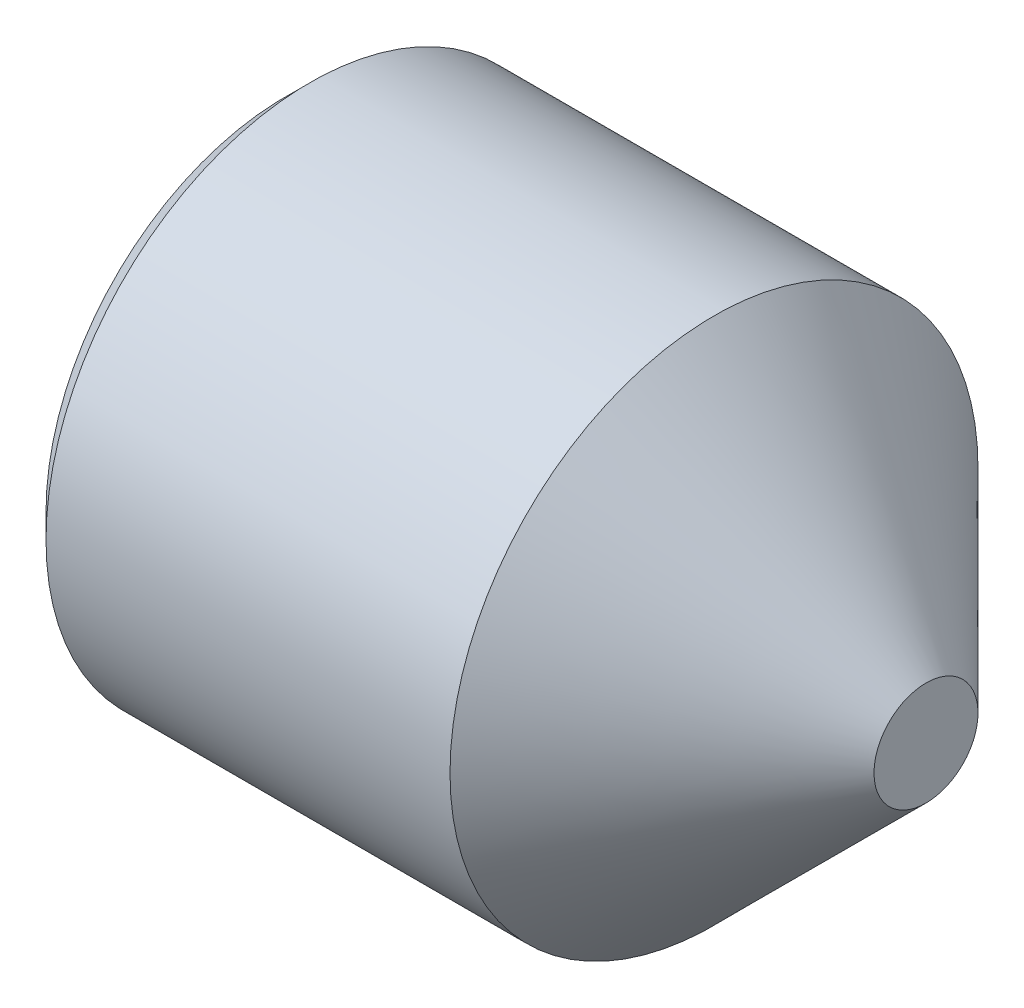
ISO-10303-21;
HEADER;
FILE_DESCRIPTION(('STEP AP214'),'2;1');
FILE_NAME('part.step','',(''),(''),'','','');
FILE_SCHEMA(('AUTOMOTIVE_DESIGN { 1 0 10303 214 1 1 1 1 }'));
ENDSEC;
DATA;
#1=APPLICATION_CONTEXT('core data for automotive mechanical design processes');
#2=APPLICATION_PROTOCOL_DEFINITION('international standard','automotive_design',2000,#1);
#3=PRODUCT_CONTEXT('',#1,'mechanical');
#4=PRODUCT('Part','Part','',(#3));
#5=PRODUCT_RELATED_PRODUCT_CATEGORY('part','',(#4));
#6=PRODUCT_DEFINITION_FORMATION('','',#4);
#7=PRODUCT_DEFINITION_CONTEXT('part definition',#1,'design');
#8=PRODUCT_DEFINITION('design','',#6,#7);
#9=PRODUCT_DEFINITION_SHAPE('','',#8);
#10=(LENGTH_UNIT() NAMED_UNIT(*) SI_UNIT(.MILLI.,.METRE.));
#11=(NAMED_UNIT(*) PLANE_ANGLE_UNIT() SI_UNIT($,.RADIAN.));
#12=(NAMED_UNIT(*) SI_UNIT($,.STERADIAN.) SOLID_ANGLE_UNIT());
#13=UNCERTAINTY_MEASURE_WITH_UNIT(LENGTH_MEASURE(1.E-05),#10,'distance_accuracy_value','');
#14=(GEOMETRIC_REPRESENTATION_CONTEXT(3) GLOBAL_UNCERTAINTY_ASSIGNED_CONTEXT((#13)) GLOBAL_UNIT_ASSIGNED_CONTEXT((#10,
#11,#12)) REPRESENTATION_CONTEXT('',''));
#15=CARTESIAN_POINT('',(0.,0.,0.));
#16=DIRECTION('',(0.,0.,1.));
#17=DIRECTION('',(1.,0.,0.));
#18=AXIS2_PLACEMENT_3D('',#15,#16,#17);
#19=CARTESIAN_POINT('',(1.19999999988631,0.,0.750555349946514));
#20=DIRECTION('',(-1.,0.,0.));
#21=DIRECTION('',(0.,0.,1.));
#22=AXIS2_PLACEMENT_3D('',#19,#20,#21);
#23=PLANE('',#22);
#24=DIRECTION('',(0.,0.,-1.));
#25=VECTOR('',#24,1.);
#26=CARTESIAN_POINT('',(1.19999999988631,0.65,0.375277674973256));
#27=LINE('',#26,#25);
#28=CARTESIAN_POINT('',(1.19999999988631,0.65,0.375277674973256));
#29=VERTEX_POINT('',#28);
#30=CARTESIAN_POINT('',(1.19999999988631,0.65,0.));
#31=VERTEX_POINT('',#30);
#32=EDGE_CURVE('E162',#29,#31,#27,.T.);
#33=ORIENTED_EDGE('',*,*,#32,.T.);
#34=CARTESIAN_POINT('',(1.19999999988631,0.,0.));
#35=DIRECTION('',(1.,0.,0.));
#36=DIRECTION('',(0.,1.,0.));
#37=AXIS2_PLACEMENT_3D('',#34,#35,#36);
#38=CIRCLE('',#37,0.65);
#39=CARTESIAN_POINT('',(1.19999999988631,0.325000000000001,0.562916512459885));
#40=VERTEX_POINT('',#39);
#41=EDGE_CURVE('E51',#31,#40,#38,.T.);
#42=ORIENTED_EDGE('',*,*,#41,.T.);
#43=DIRECTION('',(0.,0.866025403784438,-0.500000000000001));
#44=VECTOR('',#43,1.);
#45=CARTESIAN_POINT('',(1.19999999988631,0.,0.750555349946514));
#46=LINE('',#45,#44);
#47=EDGE_CURVE('E218',#40,#29,#46,.T.);
#48=ORIENTED_EDGE('',*,*,#47,.T.);
#49=EDGE_LOOP('',(#33,#42,#48));
#50=FACE_BOUND('',#49,.T.);
#51=ADVANCED_FACE('F40',(#50),#23,.T.);
#52=CARTESIAN_POINT('',(1.19999999988631,0.,0.750555349946514));
#53=VERTEX_POINT('',#52);
#54=EDGE_CURVE('E223',#53,#40,#46,.T.);
#55=ORIENTED_EDGE('',*,*,#54,.T.);
#56=CARTESIAN_POINT('',(1.19999999988631,-0.325,0.562916512459885));
#57=VERTEX_POINT('',#56);
#58=EDGE_CURVE('E11',#40,#57,#38,.T.);
#59=ORIENTED_EDGE('',*,*,#58,.T.);
#60=DIRECTION('',(0.,0.866025403784438,0.5));
#61=VECTOR('',#60,1.);
#62=CARTESIAN_POINT('',(1.19999999988631,-0.65,0.375277674973257));
#63=LINE('',#62,#61);
#64=EDGE_CURVE('E188',#57,#53,#63,.T.);
#65=ORIENTED_EDGE('',*,*,#64,.T.);
#66=EDGE_LOOP('',(#55,#59,#65));
#67=FACE_BOUND('',#66,.T.);
#68=ADVANCED_FACE('F127',(#67),#23,.T.);
#69=CARTESIAN_POINT('',(1.19999999988631,-0.65,0.375277674973257));
#70=VERTEX_POINT('',#69);
#71=EDGE_CURVE('E224',#70,#57,#63,.T.);
#72=ORIENTED_EDGE('',*,*,#71,.T.);
#73=CARTESIAN_POINT('',(1.19999999988631,-0.65,0.));
#74=VERTEX_POINT('',#73);
#75=EDGE_CURVE('E49',#57,#74,#38,.T.);
#76=ORIENTED_EDGE('',*,*,#75,.T.);
#77=DIRECTION('',(0.,0.,1.));
#78=VECTOR('',#77,1.);
#79=CARTESIAN_POINT('',(1.19999999988631,-0.65,-0.375277674973256));
#80=LINE('',#79,#78);
#81=EDGE_CURVE('E167',#74,#70,#80,.T.);
#82=ORIENTED_EDGE('',*,*,#81,.T.);
#83=EDGE_LOOP('',(#72,#76,#82));
#84=FACE_BOUND('',#83,.T.);
#85=ADVANCED_FACE('F133',(#84),#23,.T.);
#86=CARTESIAN_POINT('',(1.19999999988631,-0.65,-0.375277674973256));
#87=VERTEX_POINT('',#86);
#88=EDGE_CURVE('E168',#87,#74,#80,.T.);
#89=ORIENTED_EDGE('',*,*,#88,.T.);
#90=CARTESIAN_POINT('',(1.19999999988631,-0.325,-0.562916512459885));
#91=VERTEX_POINT('',#90);
#92=EDGE_CURVE('E215',#74,#91,#38,.T.);
#93=ORIENTED_EDGE('',*,*,#92,.T.);
#94=DIRECTION('',(0.,-0.866025403784438,0.5));
#95=VECTOR('',#94,1.);
#96=CARTESIAN_POINT('',(1.19999999988631,0.,-0.750555349946513));
#97=LINE('',#96,#95);
#98=EDGE_CURVE('E157',#91,#87,#97,.T.);
#99=ORIENTED_EDGE('',*,*,#98,.T.);
#100=EDGE_LOOP('',(#89,#93,#99));
#101=FACE_BOUND('',#100,.T.);
#102=ADVANCED_FACE('F146',(#101),#23,.T.);
#103=CARTESIAN_POINT('',(1.19999999988631,0.,-0.750555349946513));
#104=VERTEX_POINT('',#103);
#105=EDGE_CURVE('E160',#104,#91,#97,.T.);
#106=ORIENTED_EDGE('',*,*,#105,.T.);
#107=CARTESIAN_POINT('',(1.19999999988631,0.325,-0.562916512459885));
#108=VERTEX_POINT('',#107);
#109=EDGE_CURVE('E213',#91,#108,#38,.T.);
#110=ORIENTED_EDGE('',*,*,#109,.T.);
#111=DIRECTION('',(0.,-0.866025403784439,-0.5));
#112=VECTOR('',#111,1.);
#113=CARTESIAN_POINT('',(1.19999999988631,0.65,-0.375277674973257));
#114=LINE('',#113,#112);
#115=EDGE_CURVE('E158',#108,#104,#114,.T.);
#116=ORIENTED_EDGE('',*,*,#115,.T.);
#117=EDGE_LOOP('',(#106,#110,#116));
#118=FACE_BOUND('',#117,.T.);
#119=ADVANCED_FACE('F138',(#118),#23,.T.);
#120=CARTESIAN_POINT('',(1.19999999988631,0.65,-0.375277674973257));
#121=VERTEX_POINT('',#120);
#122=EDGE_CURVE('E150',#121,#108,#114,.T.);
#123=ORIENTED_EDGE('',*,*,#122,.T.);
#124=EDGE_CURVE('E151',#108,#31,#38,.T.);
#125=ORIENTED_EDGE('',*,*,#124,.T.);
#126=EDGE_CURVE('E153',#31,#121,#27,.T.);
#127=ORIENTED_EDGE('',*,*,#126,.T.);
#128=EDGE_LOOP('',(#123,#125,#127));
#129=FACE_BOUND('',#128,.T.);
#130=ADVANCED_FACE('F129',(#129),#23,.T.);
#131=CARTESIAN_POINT('',(0.,1.5,0.));
#132=DIRECTION('',(1.,0.,0.));
#133=DIRECTION('',(0.,0.,-1.));
#134=AXIS2_PLACEMENT_3D('',#131,#132,#133);
#135=PLANE('',#134);
#136=DIRECTION('',(0.,0.866025403784438,-0.500000000000001));
#137=VECTOR('',#136,1.);
#138=CARTESIAN_POINT('',(-1.13686837721616E-10,0.,0.750555349946514));
#139=LINE('',#138,#137);
#140=CARTESIAN_POINT('',(0.,0.,0.750555349946514));
#141=VERTEX_POINT('',#140);
#142=CARTESIAN_POINT('',(-1.13686837721616E-10,0.65,0.375277674973256));
#143=VERTEX_POINT('',#142);
#144=EDGE_CURVE('E173',#141,#143,#139,.T.);
#145=ORIENTED_EDGE('',*,*,#144,.F.);
#146=DIRECTION('',(0.,0.866025403784438,0.5));
#147=VECTOR('',#146,1.);
#148=CARTESIAN_POINT('',(-1.13686837721616E-10,-0.65,0.375277674973257));
#149=LINE('',#148,#147);
#150=CARTESIAN_POINT('',(-1.13686837721616E-10,-0.65,0.375277674973257));
#151=VERTEX_POINT('',#150);
#152=EDGE_CURVE('E65',#151,#141,#149,.T.);
#153=ORIENTED_EDGE('',*,*,#152,.F.);
#154=DIRECTION('',(0.,0.,1.));
#155=VECTOR('',#154,1.);
#156=CARTESIAN_POINT('',(-1.13686837721616E-10,-0.65,-0.375277674973256));
#157=LINE('',#156,#155);
#158=CARTESIAN_POINT('',(-1.13686837721616E-10,-0.65,-0.375277674973256));
#159=VERTEX_POINT('',#158);
#160=EDGE_CURVE('E185',#159,#151,#157,.T.);
#161=ORIENTED_EDGE('',*,*,#160,.F.);
#162=DIRECTION('',(0.,-0.866025403784438,0.5));
#163=VECTOR('',#162,1.);
#164=CARTESIAN_POINT('',(-1.13686837721616E-10,0.,-0.750555349946513));
#165=LINE('',#164,#163);
#166=CARTESIAN_POINT('',(-1.13686837721616E-10,0.,-0.750555349946513));
#167=VERTEX_POINT('',#166);
#168=EDGE_CURVE('E182',#167,#159,#165,.T.);
#169=ORIENTED_EDGE('',*,*,#168,.F.);
#170=DIRECTION('',(0.,-0.866025403784439,-0.5));
#171=VECTOR('',#170,1.);
#172=CARTESIAN_POINT('',(-1.13686837721616E-10,0.65,-0.375277674973257));
#173=LINE('',#172,#171);
#174=CARTESIAN_POINT('',(-1.13686837721616E-10,0.65,-0.375277674973257));
#175=VERTEX_POINT('',#174);
#176=EDGE_CURVE('E179',#175,#167,#173,.T.);
#177=ORIENTED_EDGE('',*,*,#176,.F.);
#178=DIRECTION('',(0.,0.,-1.));
#179=VECTOR('',#178,1.);
#180=CARTESIAN_POINT('',(-1.13686837721616E-10,0.65,0.375277674973256));
#181=LINE('',#180,#179);
#182=EDGE_CURVE('E176',#143,#175,#181,.T.);
#183=ORIENTED_EDGE('',*,*,#182,.F.);
#184=EDGE_LOOP('',(#145,#153,#161,#169,#177,#183));
#185=FACE_BOUND('',#184,.T.);
#186=CARTESIAN_POINT('',(0.,0.,0.));
#187=DIRECTION('',(-1.,0.,0.));
#188=DIRECTION('',(0.,0.,1.));
#189=AXIS2_PLACEMENT_3D('',#186,#187,#188);
#190=CIRCLE('',#189,1.5);
#191=CARTESIAN_POINT('',(0.,0.,1.5));
#192=VERTEX_POINT('',#191);
#193=EDGE_CURVE('E191',#192,#192,#190,.T.);
#194=ORIENTED_EDGE('',*,*,#193,.T.);
#195=EDGE_LOOP('',(#194));
#196=FACE_BOUND('',#195,.T.);
#197=ADVANCED_FACE('F42',(#185,#196),#135,.F.);
#198=CARTESIAN_POINT('',(4.,0.,0.));
#199=DIRECTION('',(-1.,0.,0.));
#200=DIRECTION('',(0.,0.,1.));
#201=AXIS2_PLACEMENT_3D('',#198,#199,#200);
#202=PLANE('',#201);
#203=CARTESIAN_POINT('',(4.,0.,0.));
#204=DIRECTION('',(-1.,0.,0.));
#205=DIRECTION('',(0.,0.,1.));
#206=AXIS2_PLACEMENT_3D('',#203,#204,#205);
#207=CIRCLE('',#206,0.325);
#208=CARTESIAN_POINT('',(4.,0.,0.325));
#209=VERTEX_POINT('',#208);
#210=EDGE_CURVE('E44',#209,#209,#207,.T.);
#211=ORIENTED_EDGE('',*,*,#210,.F.);
#212=EDGE_LOOP('',(#211));
#213=FACE_BOUND('',#212,.T.);
#214=ADVANCED_FACE('F144',(#213),#202,.F.);
#215=CARTESIAN_POINT('',(4.,0.,0.));
#216=DIRECTION('',(-1.,0.,0.));
#217=DIRECTION('',(0.,0.,1.));
#218=AXIS2_PLACEMENT_3D('',#215,#216,#217);
#219=CONICAL_SURFACE('',#218,0.325,0.785398163397443);
#220=CARTESIAN_POINT('',(2.67499999999998,0.,0.));
#221=DIRECTION('',(-1.,0.,0.));
#222=DIRECTION('',(0.,0.,1.));
#223=AXIS2_PLACEMENT_3D('',#220,#221,#222);
#224=CIRCLE('',#223,1.65);
#225=CARTESIAN_POINT('',(2.67499999999998,0.,1.65));
#226=VERTEX_POINT('',#225);
#227=EDGE_CURVE('E206',#226,#226,#224,.T.);
#228=ORIENTED_EDGE('',*,*,#227,.F.);
#229=EDGE_LOOP('',(#228));
#230=FACE_BOUND('',#229,.T.);
#231=ORIENTED_EDGE('',*,*,#210,.T.);
#232=EDGE_LOOP('',(#231));
#233=FACE_BOUND('',#232,.T.);
#234=ADVANCED_FACE('F271',(#230,#233),#219,.T.);
#235=CARTESIAN_POINT('',(-14.774129749189,0.,0.));
#236=DIRECTION('',(-1.,0.,0.));
#237=DIRECTION('',(0.,0.,1.));
#238=AXIS2_PLACEMENT_3D('',#235,#236,#237);
#239=CYLINDRICAL_SURFACE('',#238,1.65);
#240=CARTESIAN_POINT('',(0.150000000000001,0.,0.));
#241=DIRECTION('',(-1.,0.,0.));
#242=DIRECTION('',(0.,0.,1.));
#243=AXIS2_PLACEMENT_3D('',#240,#241,#242);
#244=CIRCLE('',#243,1.65);
#245=CARTESIAN_POINT('',(0.150000000000001,0.,1.65));
#246=VERTEX_POINT('',#245);
#247=EDGE_CURVE('E204',#246,#246,#244,.T.);
#248=ORIENTED_EDGE('',*,*,#247,.F.);
#249=EDGE_LOOP('',(#248));
#250=FACE_BOUND('',#249,.T.);
#251=ORIENTED_EDGE('',*,*,#227,.T.);
#252=EDGE_LOOP('',(#251));
#253=FACE_BOUND('',#252,.T.);
#254=ADVANCED_FACE('F267',(#250,#253),#239,.T.);
#255=CARTESIAN_POINT('',(0.150000000000001,0.,0.));
#256=DIRECTION('',(1.,0.,0.));
#257=DIRECTION('',(0.,0.,-1.));
#258=AXIS2_PLACEMENT_3D('',#255,#256,#257);
#259=CONICAL_SURFACE('',#258,1.65,0.785398163397444);
#260=ORIENTED_EDGE('',*,*,#193,.F.);
#261=EDGE_LOOP('',(#260));
#262=FACE_BOUND('',#261,.T.);
#263=ORIENTED_EDGE('',*,*,#247,.T.);
#264=EDGE_LOOP('',(#263));
#265=FACE_BOUND('',#264,.T.);
#266=ADVANCED_FACE('F258',(#262,#265),#259,.T.);
#267=CARTESIAN_POINT('',(1.19999999988631,-0.65,0.375277674973257));
#268=DIRECTION('',(0.,-0.5,0.866025403784439));
#269=DIRECTION('',(0.,-0.866025403784439,-0.5));
#270=AXIS2_PLACEMENT_3D('',#267,#268,#269);
#271=PLANE('',#270);
#272=ORIENTED_EDGE('',*,*,#152,.T.);
#273=DIRECTION('',(-1.,0.,0.));
#274=VECTOR('',#273,1.);
#275=CARTESIAN_POINT('',(1.19999999988631,0.,0.750555349946514));
#276=LINE('',#275,#274);
#277=EDGE_CURVE('E171',#53,#141,#276,.T.);
#278=ORIENTED_EDGE('',*,*,#277,.F.);
#279=ORIENTED_EDGE('',*,*,#64,.F.);
#280=ORIENTED_EDGE('',*,*,#71,.F.);
#281=DIRECTION('',(-1.,0.,0.));
#282=VECTOR('',#281,1.);
#283=CARTESIAN_POINT('',(1.19999999988631,-0.65,0.375277674973257));
#284=LINE('',#283,#282);
#285=EDGE_CURVE('E189',#70,#151,#284,.T.);
#286=ORIENTED_EDGE('',*,*,#285,.T.);
#287=EDGE_LOOP('',(#272,#278,#279,#280,#286));
#288=FACE_BOUND('',#287,.T.);
#289=ADVANCED_FACE('F232',(#288),#271,.F.);
#290=CARTESIAN_POINT('',(1.19999999988631,-0.65,-0.375277674973256));
#291=DIRECTION('',(0.,-1.,0.));
#292=DIRECTION('',(0.,0.,-1.));
#293=AXIS2_PLACEMENT_3D('',#290,#291,#292);
#294=PLANE('',#293);
#295=ORIENTED_EDGE('',*,*,#160,.T.);
#296=ORIENTED_EDGE('',*,*,#285,.F.);
#297=ORIENTED_EDGE('',*,*,#81,.F.);
#298=ORIENTED_EDGE('',*,*,#88,.F.);
#299=DIRECTION('',(-1.,0.,0.));
#300=VECTOR('',#299,1.);
#301=CARTESIAN_POINT('',(1.19999999988631,-0.65,-0.375277674973256));
#302=LINE('',#301,#300);
#303=EDGE_CURVE('E192',#87,#159,#302,.T.);
#304=ORIENTED_EDGE('',*,*,#303,.T.);
#305=EDGE_LOOP('',(#295,#296,#297,#298,#304));
#306=FACE_BOUND('',#305,.T.);
#307=ADVANCED_FACE('F251',(#306),#294,.F.);
#308=CARTESIAN_POINT('',(1.19999999988631,0.,-0.750555349946513));
#309=DIRECTION('',(0.,-0.5,-0.866025403784438));
#310=DIRECTION('',(0.,0.866025403784439,-0.5));
#311=AXIS2_PLACEMENT_3D('',#308,#309,#310);
#312=PLANE('',#311);
#313=ORIENTED_EDGE('',*,*,#168,.T.);
#314=ORIENTED_EDGE('',*,*,#303,.F.);
#315=ORIENTED_EDGE('',*,*,#98,.F.);
#316=ORIENTED_EDGE('',*,*,#105,.F.);
#317=DIRECTION('',(-1.,0.,0.));
#318=VECTOR('',#317,1.);
#319=CARTESIAN_POINT('',(1.19999999988631,0.,-0.750555349946513));
#320=LINE('',#319,#318);
#321=EDGE_CURVE('E194',#104,#167,#320,.T.);
#322=ORIENTED_EDGE('',*,*,#321,.T.);
#323=EDGE_LOOP('',(#313,#314,#315,#316,#322));
#324=FACE_BOUND('',#323,.T.);
#325=ADVANCED_FACE('F245',(#324),#312,.F.);
#326=CARTESIAN_POINT('',(1.19999999988631,0.65,-0.375277674973257));
#327=DIRECTION('',(0.,0.5,-0.866025403784439));
#328=DIRECTION('',(0.,0.866025403784439,0.5));
#329=AXIS2_PLACEMENT_3D('',#326,#327,#328);
#330=PLANE('',#329);
#331=ORIENTED_EDGE('',*,*,#176,.T.);
#332=ORIENTED_EDGE('',*,*,#321,.F.);
#333=ORIENTED_EDGE('',*,*,#115,.F.);
#334=ORIENTED_EDGE('',*,*,#122,.F.);
#335=DIRECTION('',(-1.,0.,0.));
#336=VECTOR('',#335,1.);
#337=CARTESIAN_POINT('',(1.19999999988631,0.65,-0.375277674973257));
#338=LINE('',#337,#336);
#339=EDGE_CURVE('E196',#121,#175,#338,.T.);
#340=ORIENTED_EDGE('',*,*,#339,.T.);
#341=EDGE_LOOP('',(#331,#332,#333,#334,#340));
#342=FACE_BOUND('',#341,.T.);
#343=ADVANCED_FACE('F240',(#342),#330,.F.);
#344=CARTESIAN_POINT('',(1.19999999988631,0.65,0.375277674973256));
#345=DIRECTION('',(0.,1.,0.));
#346=DIRECTION('',(0.,0.,1.));
#347=AXIS2_PLACEMENT_3D('',#344,#345,#346);
#348=PLANE('',#347);
#349=ORIENTED_EDGE('',*,*,#182,.T.);
#350=ORIENTED_EDGE('',*,*,#339,.F.);
#351=ORIENTED_EDGE('',*,*,#126,.F.);
#352=ORIENTED_EDGE('',*,*,#32,.F.);
#353=DIRECTION('',(-1.,0.,0.));
#354=VECTOR('',#353,1.);
#355=CARTESIAN_POINT('',(1.19999999988631,0.65,0.375277674973256));
#356=LINE('',#355,#354);
#357=EDGE_CURVE('E198',#29,#143,#356,.T.);
#358=ORIENTED_EDGE('',*,*,#357,.T.);
#359=EDGE_LOOP('',(#349,#350,#351,#352,#358));
#360=FACE_BOUND('',#359,.T.);
#361=ADVANCED_FACE('F122',(#360),#348,.F.);
#362=CARTESIAN_POINT('',(1.19999999988631,0.,0.750555349946514));
#363=DIRECTION('',(0.,0.5,0.866025403784438));
#364=DIRECTION('',(0.,-0.866025403784438,0.500000000000001));
#365=AXIS2_PLACEMENT_3D('',#362,#363,#364);
#366=PLANE('',#365);
#367=ORIENTED_EDGE('',*,*,#144,.T.);
#368=ORIENTED_EDGE('',*,*,#357,.F.);
#369=ORIENTED_EDGE('',*,*,#47,.F.);
#370=ORIENTED_EDGE('',*,*,#54,.F.);
#371=ORIENTED_EDGE('',*,*,#277,.T.);
#372=EDGE_LOOP('',(#367,#368,#369,#370,#371));
#373=FACE_BOUND('',#372,.T.);
#374=ADVANCED_FACE('F117',(#373),#366,.F.);
#375=CARTESIAN_POINT('',(1.57527767485957,0.,0.));
#376=DIRECTION('',(-1.,0.,0.));
#377=DIRECTION('',(0.,-1.,0.));
#378=AXIS2_PLACEMENT_3D('',#375,#376,#377);
#379=CONICAL_SURFACE('',#378,0.,1.0471975511966);
#380=ORIENTED_EDGE('',*,*,#41,.F.);
#381=ORIENTED_EDGE('',*,*,#124,.F.);
#382=ORIENTED_EDGE('',*,*,#109,.F.);
#383=ORIENTED_EDGE('',*,*,#92,.F.);
#384=ORIENTED_EDGE('',*,*,#75,.F.);
#385=ORIENTED_EDGE('',*,*,#58,.F.);
#386=EDGE_LOOP('',(#380,#381,#382,#383,#384,#385));
#387=FACE_BOUND('',#386,.T.);
#388=CARTESIAN_POINT('',(1.57527767485957,0.,0.));
#389=VERTEX_POINT('',#388);
#390=VERTEX_LOOP('',#389);
#391=FACE_BOUND('',#390,.T.);
#392=ADVANCED_FACE('F115',(#387,#391),#379,.F.);
#393=CLOSED_SHELL('',(#51,#68,#85,#102,#119,#130,#197,#214,#234,#254,#266,#289,#307,#325,#343,
#361,#374,#392));
#394=MANIFOLD_SOLID_BREP('B2',#393);
#395=ADVANCED_BREP_SHAPE_REPRESENTATION('',(#18,#394),#14);
#396=SHAPE_DEFINITION_REPRESENTATION(#9,#395);
ENDSEC;
END-ISO-10303-21;
